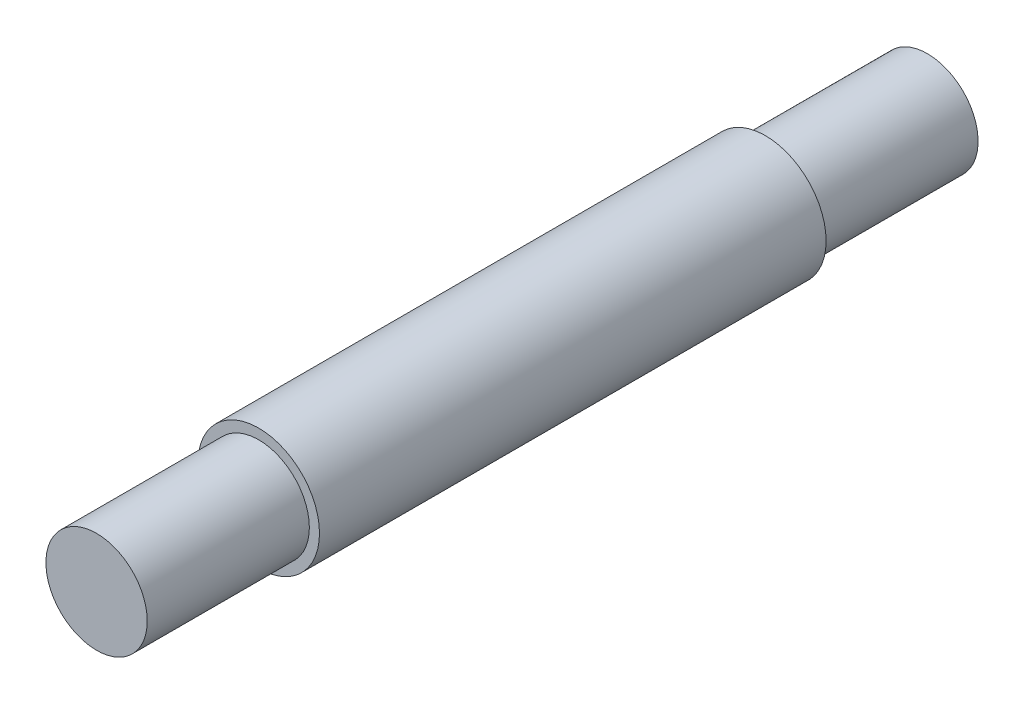
ISO-10303-21;
HEADER;
FILE_DESCRIPTION(('STEP AP214'),'2;1');
FILE_NAME('part.step','',(''),(''),'','','');
FILE_SCHEMA(('AUTOMOTIVE_DESIGN { 1 0 10303 214 1 1 1 1 }'));
ENDSEC;
DATA;
#1=APPLICATION_CONTEXT('core data for automotive mechanical design processes');
#2=APPLICATION_PROTOCOL_DEFINITION('international standard','automotive_design',2000,#1);
#3=PRODUCT_CONTEXT('',#1,'mechanical');
#4=PRODUCT('Part','Part','',(#3));
#5=PRODUCT_RELATED_PRODUCT_CATEGORY('part','',(#4));
#6=PRODUCT_DEFINITION_FORMATION('','',#4);
#7=PRODUCT_DEFINITION_CONTEXT('part definition',#1,'design');
#8=PRODUCT_DEFINITION('design','',#6,#7);
#9=PRODUCT_DEFINITION_SHAPE('','',#8);
#10=(LENGTH_UNIT() NAMED_UNIT(*) SI_UNIT(.MILLI.,.METRE.));
#11=(NAMED_UNIT(*) PLANE_ANGLE_UNIT() SI_UNIT($,.RADIAN.));
#12=(NAMED_UNIT(*) SI_UNIT($,.STERADIAN.) SOLID_ANGLE_UNIT());
#13=UNCERTAINTY_MEASURE_WITH_UNIT(LENGTH_MEASURE(1.E-05),#10,'distance_accuracy_value','');
#14=(GEOMETRIC_REPRESENTATION_CONTEXT(3) GLOBAL_UNCERTAINTY_ASSIGNED_CONTEXT((#13)) GLOBAL_UNIT_ASSIGNED_CONTEXT((#10,
#11,#12)) REPRESENTATION_CONTEXT('',''));
#15=CARTESIAN_POINT('',(0.,0.,0.));
#16=DIRECTION('',(0.,0.,1.));
#17=DIRECTION('',(1.,0.,0.));
#18=AXIS2_PLACEMENT_3D('',#15,#16,#17);
#19=CARTESIAN_POINT('',(0.,0.,50.));
#20=DIRECTION('',(0.,0.,-1.));
#21=DIRECTION('',(-1.,0.,0.));
#22=AXIS2_PLACEMENT_3D('',#19,#20,#21);
#23=CYLINDRICAL_SURFACE('',#22,6.);
#24=CARTESIAN_POINT('',(0.,0.,50.));
#25=DIRECTION('',(0.,0.,1.));
#26=DIRECTION('',(1.,0.,0.));
#27=AXIS2_PLACEMENT_3D('',#24,#25,#26);
#28=CIRCLE('',#27,6.);
#29=CARTESIAN_POINT('',(6.,0.,50.));
#30=VERTEX_POINT('',#29);
#31=EDGE_CURVE('E55',#30,#30,#28,.T.);
#32=ORIENTED_EDGE('',*,*,#31,.F.);
#33=EDGE_LOOP('',(#32));
#34=FACE_BOUND('',#33,.T.);
#35=CARTESIAN_POINT('',(0.,0.,0.));
#36=DIRECTION('',(0.,0.,1.));
#37=DIRECTION('',(1.,0.,0.));
#38=AXIS2_PLACEMENT_3D('',#35,#36,#37);
#39=CIRCLE('',#38,6.);
#40=CARTESIAN_POINT('',(6.,0.,0.));
#41=VERTEX_POINT('',#40);
#42=EDGE_CURVE('E44',#41,#41,#39,.T.);
#43=ORIENTED_EDGE('',*,*,#42,.T.);
#44=EDGE_LOOP('',(#43));
#45=FACE_BOUND('',#44,.T.);
#46=ADVANCED_FACE('F41',(#34,#45),#23,.T.);
#47=CARTESIAN_POINT('',(0.,0.,50.));
#48=DIRECTION('',(0.,0.,1.));
#49=DIRECTION('',(1.,0.,0.));
#50=AXIS2_PLACEMENT_3D('',#47,#48,#49);
#51=PLANE('',#50);
#52=CARTESIAN_POINT('',(0.,0.,50.));
#53=DIRECTION('',(0.,0.,1.));
#54=DIRECTION('',(1.,0.,0.));
#55=AXIS2_PLACEMENT_3D('',#52,#53,#54);
#56=CIRCLE('',#55,5.);
#57=CARTESIAN_POINT('',(5.,0.,50.));
#58=VERTEX_POINT('',#57);
#59=EDGE_CURVE('E49',#58,#58,#56,.T.);
#60=ORIENTED_EDGE('',*,*,#59,.F.);
#61=EDGE_LOOP('',(#60));
#62=FACE_BOUND('',#61,.T.);
#63=ORIENTED_EDGE('',*,*,#31,.T.);
#64=EDGE_LOOP('',(#63));
#65=FACE_BOUND('',#64,.T.);
#66=ADVANCED_FACE('F75',(#62,#65),#51,.T.);
#67=CARTESIAN_POINT('',(0.,0.,0.));
#68=DIRECTION('',(0.,0.,1.));
#69=DIRECTION('',(1.,0.,0.));
#70=AXIS2_PLACEMENT_3D('',#67,#68,#69);
#71=PLANE('',#70);
#72=CARTESIAN_POINT('',(0.,0.,0.));
#73=DIRECTION('',(0.,0.,-1.));
#74=DIRECTION('',(-1.,0.,0.));
#75=AXIS2_PLACEMENT_3D('',#72,#73,#74);
#76=CIRCLE('',#75,5.);
#77=CARTESIAN_POINT('',(-5.,0.,0.));
#78=VERTEX_POINT('',#77);
#79=EDGE_CURVE('E10',#78,#78,#76,.T.);
#80=ORIENTED_EDGE('',*,*,#79,.F.);
#81=EDGE_LOOP('',(#80));
#82=FACE_BOUND('',#81,.T.);
#83=ORIENTED_EDGE('',*,*,#42,.F.);
#84=EDGE_LOOP('',(#83));
#85=FACE_BOUND('',#84,.T.);
#86=ADVANCED_FACE('F72',(#82,#85),#71,.F.);
#87=CARTESIAN_POINT('',(0.,0.,66.));
#88=DIRECTION('',(0.,0.,-1.));
#89=DIRECTION('',(-1.,0.,0.));
#90=AXIS2_PLACEMENT_3D('',#87,#88,#89);
#91=CYLINDRICAL_SURFACE('',#90,5.);
#92=CARTESIAN_POINT('',(0.,0.,66.));
#93=DIRECTION('',(0.,0.,1.));
#94=DIRECTION('',(1.,0.,0.));
#95=AXIS2_PLACEMENT_3D('',#92,#93,#94);
#96=CIRCLE('',#95,5.);
#97=CARTESIAN_POINT('',(5.,0.,66.));
#98=VERTEX_POINT('',#97);
#99=EDGE_CURVE('E60',#98,#98,#96,.T.);
#100=ORIENTED_EDGE('',*,*,#99,.F.);
#101=EDGE_LOOP('',(#100));
#102=FACE_BOUND('',#101,.T.);
#103=ORIENTED_EDGE('',*,*,#59,.T.);
#104=EDGE_LOOP('',(#103));
#105=FACE_BOUND('',#104,.T.);
#106=ADVANCED_FACE('F74',(#102,#105),#91,.T.);
#107=CARTESIAN_POINT('',(0.,0.,66.));
#108=DIRECTION('',(0.,0.,1.));
#109=DIRECTION('',(1.,0.,0.));
#110=AXIS2_PLACEMENT_3D('',#107,#108,#109);
#111=PLANE('',#110);
#112=ORIENTED_EDGE('',*,*,#99,.T.);
#113=EDGE_LOOP('',(#112));
#114=FACE_BOUND('',#113,.T.);
#115=ADVANCED_FACE('F81',(#114),#111,.T.);
#116=CARTESIAN_POINT('',(0.,0.,-16.));
#117=DIRECTION('',(0.,0.,1.));
#118=DIRECTION('',(1.,0.,0.));
#119=AXIS2_PLACEMENT_3D('',#116,#117,#118);
#120=CYLINDRICAL_SURFACE('',#119,5.);
#121=CARTESIAN_POINT('',(0.,0.,-16.));
#122=DIRECTION('',(0.,0.,-1.));
#123=DIRECTION('',(-1.,0.,0.));
#124=AXIS2_PLACEMENT_3D('',#121,#122,#123);
#125=CIRCLE('',#124,5.);
#126=CARTESIAN_POINT('',(-5.,0.,-16.));
#127=VERTEX_POINT('',#126);
#128=EDGE_CURVE('E59',#127,#127,#125,.T.);
#129=ORIENTED_EDGE('',*,*,#128,.F.);
#130=EDGE_LOOP('',(#129));
#131=FACE_BOUND('',#130,.T.);
#132=ORIENTED_EDGE('',*,*,#79,.T.);
#133=EDGE_LOOP('',(#132));
#134=FACE_BOUND('',#133,.T.);
#135=ADVANCED_FACE('F111',(#131,#134),#120,.T.);
#136=CARTESIAN_POINT('',(0.,0.,-16.));
#137=DIRECTION('',(0.,0.,-1.));
#138=DIRECTION('',(-1.,0.,0.));
#139=AXIS2_PLACEMENT_3D('',#136,#137,#138);
#140=PLANE('',#139);
#141=ORIENTED_EDGE('',*,*,#128,.T.);
#142=EDGE_LOOP('',(#141));
#143=FACE_BOUND('',#142,.T.);
#144=ADVANCED_FACE('F127',(#143),#140,.T.);
#145=CLOSED_SHELL('',(#46,#66,#86,#106,#115,#135,#144));
#146=MANIFOLD_SOLID_BREP('B2',#145);
#147=ADVANCED_BREP_SHAPE_REPRESENTATION('',(#18,#146),#14);
#148=SHAPE_DEFINITION_REPRESENTATION(#9,#147);
ENDSEC;
END-ISO-10303-21;
